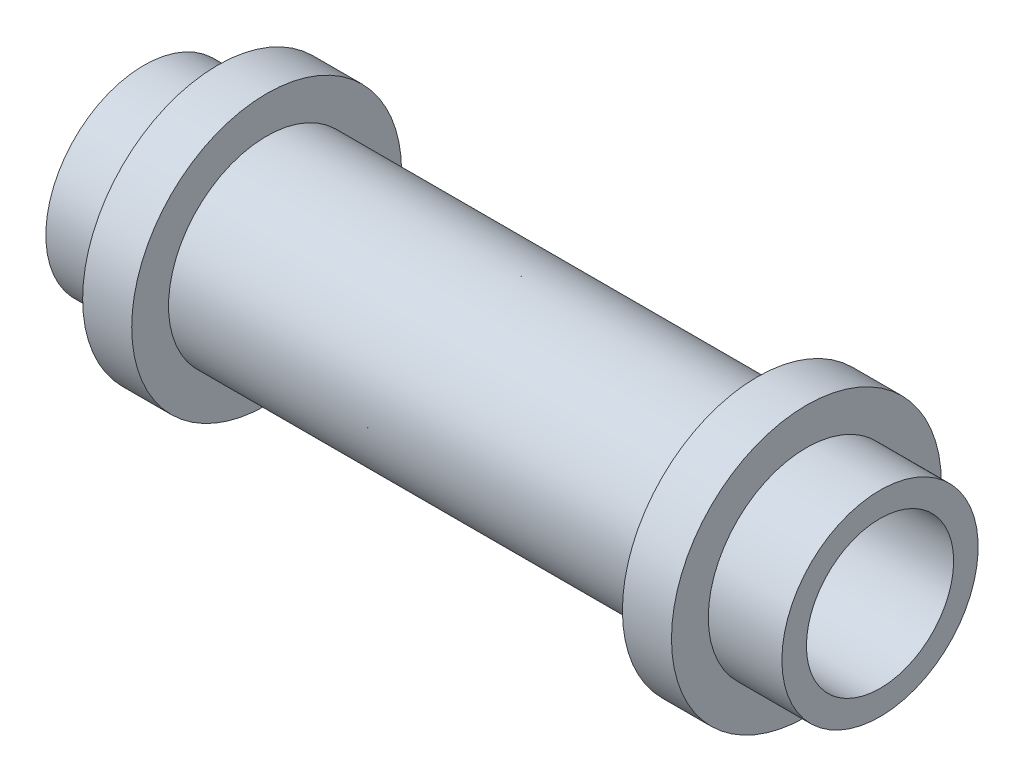
ISO-10303-21;
HEADER;
FILE_DESCRIPTION(('STEP AP214'),'2;1');
FILE_NAME('part.step','',(''),(''),'','','');
FILE_SCHEMA(('AUTOMOTIVE_DESIGN { 1 0 10303 214 1 1 1 1 }'));
ENDSEC;
DATA;
#1=APPLICATION_CONTEXT('core data for automotive mechanical design processes');
#2=APPLICATION_PROTOCOL_DEFINITION('international standard','automotive_design',2000,#1);
#3=PRODUCT_CONTEXT('',#1,'mechanical');
#4=PRODUCT('Part','Part','',(#3));
#5=PRODUCT_RELATED_PRODUCT_CATEGORY('part','',(#4));
#6=PRODUCT_DEFINITION_FORMATION('','',#4);
#7=PRODUCT_DEFINITION_CONTEXT('part definition',#1,'design');
#8=PRODUCT_DEFINITION('design','',#6,#7);
#9=PRODUCT_DEFINITION_SHAPE('','',#8);
#10=(LENGTH_UNIT() NAMED_UNIT(*) SI_UNIT(.MILLI.,.METRE.));
#11=(NAMED_UNIT(*) PLANE_ANGLE_UNIT() SI_UNIT($,.RADIAN.));
#12=(NAMED_UNIT(*) SI_UNIT($,.STERADIAN.) SOLID_ANGLE_UNIT());
#13=UNCERTAINTY_MEASURE_WITH_UNIT(LENGTH_MEASURE(1.E-05),#10,'distance_accuracy_value','');
#14=(GEOMETRIC_REPRESENTATION_CONTEXT(3) GLOBAL_UNCERTAINTY_ASSIGNED_CONTEXT((#13)) GLOBAL_UNIT_ASSIGNED_CONTEXT((#10,
#11,#12)) REPRESENTATION_CONTEXT('',''));
#15=CARTESIAN_POINT('',(0.,0.,0.));
#16=DIRECTION('',(0.,0.,1.));
#17=DIRECTION('',(1.,0.,0.));
#18=AXIS2_PLACEMENT_3D('',#15,#16,#17);
#19=CARTESIAN_POINT('',(3.175,0.,0.));
#20=DIRECTION('',(-1.,0.,0.));
#21=DIRECTION('',(0.,0.,1.));
#22=AXIS2_PLACEMENT_3D('',#19,#20,#21);
#23=CYLINDRICAL_SURFACE('',#22,8.73125);
#24=CARTESIAN_POINT('',(3.175,0.,0.));
#25=DIRECTION('',(1.,0.,0.));
#26=DIRECTION('',(0.,0.,-1.));
#27=AXIS2_PLACEMENT_3D('',#24,#25,#26);
#28=CIRCLE('',#27,8.73125);
#29=CARTESIAN_POINT('',(3.175,0.,-8.73125));
#30=VERTEX_POINT('',#29);
#31=EDGE_CURVE('E69',#30,#30,#28,.T.);
#32=ORIENTED_EDGE('',*,*,#31,.F.);
#33=EDGE_LOOP('',(#32));
#34=FACE_BOUND('',#33,.T.);
#35=CARTESIAN_POINT('',(0.,0.,0.));
#36=DIRECTION('',(1.,0.,0.));
#37=DIRECTION('',(0.,0.,-1.));
#38=AXIS2_PLACEMENT_3D('',#35,#36,#37);
#39=CIRCLE('',#38,8.73125);
#40=CARTESIAN_POINT('',(0.,0.,-8.73125));
#41=VERTEX_POINT('',#40);
#42=EDGE_CURVE('E38',#41,#41,#39,.T.);
#43=ORIENTED_EDGE('',*,*,#42,.T.);
#44=EDGE_LOOP('',(#43));
#45=FACE_BOUND('',#44,.T.);
#46=ADVANCED_FACE('F35',(#34,#45),#23,.T.);
#47=CARTESIAN_POINT('',(3.175,0.,0.));
#48=DIRECTION('',(1.,0.,0.));
#49=DIRECTION('',(0.,0.,-1.));
#50=AXIS2_PLACEMENT_3D('',#47,#48,#49);
#51=PLANE('',#50);
#52=CARTESIAN_POINT('',(3.175,0.,0.));
#53=DIRECTION('',(1.,0.,0.));
#54=DIRECTION('',(0.,0.,-1.));
#55=AXIS2_PLACEMENT_3D('',#52,#53,#54);
#56=CIRCLE('',#55,6.35);
#57=CARTESIAN_POINT('',(3.175,0.,-6.35));
#58=VERTEX_POINT('',#57);
#59=EDGE_CURVE('E47',#58,#58,#56,.T.);
#60=ORIENTED_EDGE('',*,*,#59,.F.);
#61=EDGE_LOOP('',(#60));
#62=FACE_BOUND('',#61,.T.);
#63=ORIENTED_EDGE('',*,*,#31,.T.);
#64=EDGE_LOOP('',(#63));
#65=FACE_BOUND('',#64,.T.);
#66=ADVANCED_FACE('F80',(#62,#65),#51,.T.);
#67=CARTESIAN_POINT('',(0.,0.,0.));
#68=DIRECTION('',(1.,0.,0.));
#69=DIRECTION('',(0.,0.,-1.));
#70=AXIS2_PLACEMENT_3D('',#67,#68,#69);
#71=PLANE('',#70);
#72=CARTESIAN_POINT('',(0.,0.,0.));
#73=DIRECTION('',(-1.,0.,0.));
#74=DIRECTION('',(0.,0.,1.));
#75=AXIS2_PLACEMENT_3D('',#72,#73,#74);
#76=CIRCLE('',#75,6.35);
#77=CARTESIAN_POINT('',(0.,0.,-6.35));
#78=VERTEX_POINT('',#77);
#79=EDGE_CURVE('E42',#78,#78,#76,.T.);
#80=ORIENTED_EDGE('',*,*,#79,.F.);
#81=EDGE_LOOP('',(#80));
#82=FACE_BOUND('',#81,.T.);
#83=ORIENTED_EDGE('',*,*,#42,.F.);
#84=EDGE_LOOP('',(#83));
#85=FACE_BOUND('',#84,.T.);
#86=ADVANCED_FACE('F77',(#82,#85),#71,.F.);
#87=CARTESIAN_POINT('',(19.05,0.,0.));
#88=DIRECTION('',(-1.,0.,0.));
#89=DIRECTION('',(0.,0.,1.));
#90=AXIS2_PLACEMENT_3D('',#87,#88,#89);
#91=CYLINDRICAL_SURFACE('',#90,6.35);
#92=ORIENTED_EDGE('',*,*,#59,.T.);
#93=EDGE_LOOP('',(#92));
#94=FACE_BOUND('',#93,.T.);
#95=CARTESIAN_POINT('',(34.925,0.,0.));
#96=DIRECTION('',(1.,0.,0.));
#97=DIRECTION('',(0.,0.,-1.));
#98=AXIS2_PLACEMENT_3D('',#95,#96,#97);
#99=CIRCLE('',#98,6.35);
#100=CARTESIAN_POINT('',(34.925,0.,-6.35));
#101=VERTEX_POINT('',#100);
#102=EDGE_CURVE('E56',#101,#101,#99,.T.);
#103=ORIENTED_EDGE('',*,*,#102,.F.);
#104=EDGE_LOOP('',(#103));
#105=FACE_BOUND('',#104,.T.);
#106=ADVANCED_FACE('F79',(#94,#105),#91,.T.);
#107=CARTESIAN_POINT('',(-4.7625,0.,0.));
#108=DIRECTION('',(1.,0.,0.));
#109=DIRECTION('',(0.,0.,-1.));
#110=AXIS2_PLACEMENT_3D('',#107,#108,#109);
#111=CYLINDRICAL_SURFACE('',#110,6.35);
#112=CARTESIAN_POINT('',(-4.7625,0.,0.));
#113=DIRECTION('',(-1.,0.,0.));
#114=DIRECTION('',(0.,0.,1.));
#115=AXIS2_PLACEMENT_3D('',#112,#113,#114);
#116=CIRCLE('',#115,6.35);
#117=CARTESIAN_POINT('',(-4.7625,0.,-6.35));
#118=VERTEX_POINT('',#117);
#119=EDGE_CURVE('E65',#118,#118,#116,.T.);
#120=CARTESIAN_POINT('',(-4.7625,0.,-6.35));
#121=CARTESIAN_POINT('',(-4.712890625,0.,-6.35));
#122=CARTESIAN_POINT('',(-4.66328125,0.,-6.35));
#123=CARTESIAN_POINT('',(-4.5640625,0.,-6.35));
#124=CARTESIAN_POINT('',(-4.514453125,0.,-6.35));
#125=CARTESIAN_POINT('',(-4.415234375,0.,-6.35));
#126=CARTESIAN_POINT('',(-4.365625,0.,-6.35));
#127=CARTESIAN_POINT('',(-4.26640625,0.,-6.35));
#128=CARTESIAN_POINT('',(-4.216796875,0.,-6.35));
#129=CARTESIAN_POINT('',(-4.117578125,0.,-6.35));
#130=CARTESIAN_POINT('',(-4.06796875,0.,-6.35));
#131=CARTESIAN_POINT('',(-3.96875,0.,-6.35));
#132=CARTESIAN_POINT('',(-3.919140625,0.,-6.35));
#133=CARTESIAN_POINT('',(-3.819921875,0.,-6.35));
#134=CARTESIAN_POINT('',(-3.7703125,0.,-6.35));
#135=CARTESIAN_POINT('',(-3.67109375,0.,-6.35));
#136=CARTESIAN_POINT('',(-3.621484375,0.,-6.35));
#137=CARTESIAN_POINT('',(-3.522265625,0.,-6.35));
#138=CARTESIAN_POINT('',(-3.47265625,0.,-6.35));
#139=CARTESIAN_POINT('',(-3.3734375,0.,-6.35));
#140=CARTESIAN_POINT('',(-3.323828125,0.,-6.35));
#141=CARTESIAN_POINT('',(-3.224609375,0.,-6.35));
#142=CARTESIAN_POINT('',(-3.175,0.,-6.35));
#143=CARTESIAN_POINT('',(-3.07578125,0.,-6.35));
#144=CARTESIAN_POINT('',(-3.026171875,0.,-6.35));
#145=CARTESIAN_POINT('',(-2.926953125,0.,-6.35));
#146=CARTESIAN_POINT('',(-2.87734375,0.,-6.35));
#147=CARTESIAN_POINT('',(-2.778125,0.,-6.35));
#148=CARTESIAN_POINT('',(-2.728515625,0.,-6.35));
#149=CARTESIAN_POINT('',(-2.629296875,0.,-6.35));
#150=CARTESIAN_POINT('',(-2.5796875,0.,-6.35));
#151=CARTESIAN_POINT('',(-2.48046875,0.,-6.35));
#152=CARTESIAN_POINT('',(-2.430859375,0.,-6.35));
#153=CARTESIAN_POINT('',(-2.331640625,0.,-6.35));
#154=CARTESIAN_POINT('',(-2.28203125,0.,-6.35));
#155=CARTESIAN_POINT('',(-2.1828125,0.,-6.35));
#156=CARTESIAN_POINT('',(-2.133203125,0.,-6.35));
#157=CARTESIAN_POINT('',(-2.033984375,0.,-6.35));
#158=CARTESIAN_POINT('',(-1.984375,0.,-6.35));
#159=CARTESIAN_POINT('',(-1.88515625,0.,-6.35));
#160=CARTESIAN_POINT('',(-1.835546875,0.,-6.35));
#161=CARTESIAN_POINT('',(-1.736328125,0.,-6.35));
#162=CARTESIAN_POINT('',(-1.68671875,0.,-6.35));
#163=CARTESIAN_POINT('',(-1.5875,0.,-6.35));
#164=CARTESIAN_POINT('',(-1.537890625,0.,-6.35));
#165=CARTESIAN_POINT('',(-1.438671875,0.,-6.35));
#166=CARTESIAN_POINT('',(-1.3890625,0.,-6.35));
#167=CARTESIAN_POINT('',(-1.28984375,0.,-6.35));
#168=CARTESIAN_POINT('',(-1.240234375,0.,-6.35));
#169=CARTESIAN_POINT('',(-1.141015625,0.,-6.35));
#170=CARTESIAN_POINT('',(-1.09140625,0.,-6.35));
#171=CARTESIAN_POINT('',(-0.992187499999999,0.,-6.35));
#172=CARTESIAN_POINT('',(-0.942578124999999,0.,-6.35));
#173=CARTESIAN_POINT('',(-0.843359375,0.,-6.35));
#174=CARTESIAN_POINT('',(-0.79375,0.,-6.35));
#175=CARTESIAN_POINT('',(-0.69453125,0.,-6.35));
#176=CARTESIAN_POINT('',(-0.644921875,0.,-6.35));
#177=CARTESIAN_POINT('',(-0.545703125,0.,-6.35));
#178=CARTESIAN_POINT('',(-0.49609375,0.,-6.35));
#179=CARTESIAN_POINT('',(-0.396875,0.,-6.35));
#180=CARTESIAN_POINT('',(-0.347265625,0.,-6.35));
#181=CARTESIAN_POINT('',(-0.248046875,0.,-6.35));
#182=CARTESIAN_POINT('',(-0.1984375,0.,-6.35));
#183=CARTESIAN_POINT('',(-0.09921875,0.,-6.35));
#184=CARTESIAN_POINT('',(-0.049609375,0.,-6.35));
#185=CARTESIAN_POINT('',(0.,0.,-6.35));
#186=B_SPLINE_CURVE_WITH_KNOTS('',3,(#120,#121,#122,#123,#124,#125,#126,#127,#128,#129,#130,
#131,#132,#133,#134,#135,#136,#137,#138,#139,#140,#141,#142,#143,#144,#145,#146,#147,#148,#149,
#150,#151,#152,#153,#154,#155,#156,#157,#158,#159,#160,#161,#162,#163,#164,#165,#166,#167,#168,
#169,#170,#171,#172,#173,#174,#175,#176,#177,#178,#179,#180,#181,#182,#183,#184,#185),
.UNSPECIFIED.,.F.,.F.,(4,2,2,2,2,2,2,2,2,2,2,2,2,2,2,2,2,2,2,2,2,2,2,2,2,2,2,2,2,2,2,2,4),(0.,
0.148828125,0.29765625,0.446484375,0.5953125,0.744140625,0.892968750000001,1.041796875,1.190625,
1.339453125,1.48828125,1.637109375,1.7859375,1.934765625,2.08359375,2.232421875,2.38125,
2.530078125,2.67890625,2.827734375,2.9765625,3.125390625,3.27421875,3.423046875,3.571875,
3.720703125,3.86953125,4.018359375,4.1671875,4.316015625,4.46484375,4.613671875,4.7625),.UNSPECIFIED.);
#187=EDGE_CURVE('BSEAM86',#118,#78,#186,.T.);
#188=ORIENTED_EDGE('',*,*,#119,.F.);
#189=ORIENTED_EDGE('',*,*,#79,.T.);
#190=ORIENTED_EDGE('',*,*,#187,.T.);
#191=ORIENTED_EDGE('',*,*,#187,.F.);
#192=EDGE_LOOP('',(#188,#190,#189,#191));
#193=FACE_BOUND('',#192,.T.);
#194=ADVANCED_FACE('F86',(#193),#111,.T.);
#195=CARTESIAN_POINT('',(-4.7625,0.,0.));
#196=DIRECTION('',(-1.,0.,0.));
#197=DIRECTION('',(0.,0.,1.));
#198=AXIS2_PLACEMENT_3D('',#195,#196,#197);
#199=PLANE('',#198);
#200=CARTESIAN_POINT('',(-4.7625,0.,0.));
#201=DIRECTION('',(-1.,0.,0.));
#202=DIRECTION('',(0.,0.,1.));
#203=AXIS2_PLACEMENT_3D('',#200,#201,#202);
#204=CIRCLE('',#203,4.7625);
#205=CARTESIAN_POINT('',(-4.7625,0.,4.7625));
#206=VERTEX_POINT('',#205);
#207=EDGE_CURVE('E62',#206,#206,#204,.T.);
#208=ORIENTED_EDGE('',*,*,#207,.F.);
#209=EDGE_LOOP('',(#208));
#210=FACE_BOUND('',#209,.T.);
#211=ORIENTED_EDGE('',*,*,#119,.T.);
#212=EDGE_LOOP('',(#211));
#213=FACE_BOUND('',#212,.T.);
#214=ADVANCED_FACE('F114',(#210,#213),#199,.T.);
#215=CARTESIAN_POINT('',(503.2375,0.,0.));
#216=DIRECTION('',(-1.,0.,0.));
#217=DIRECTION('',(0.,0.,1.));
#218=AXIS2_PLACEMENT_3D('',#215,#216,#217);
#219=CYLINDRICAL_SURFACE('',#218,4.7625);
#220=ORIENTED_EDGE('',*,*,#207,.T.);
#221=EDGE_LOOP('',(#220));
#222=FACE_BOUND('',#221,.T.);
#223=CARTESIAN_POINT('',(42.8625,0.,0.));
#224=DIRECTION('',(1.,0.,0.));
#225=DIRECTION('',(0.,0.,-1.));
#226=AXIS2_PLACEMENT_3D('',#223,#224,#225);
#227=CIRCLE('',#226,4.7625);
#228=CARTESIAN_POINT('',(42.8625,0.,-4.7625));
#229=VERTEX_POINT('',#228);
#230=EDGE_CURVE('E199',#229,#229,#227,.T.);
#231=ORIENTED_EDGE('',*,*,#230,.T.);
#232=EDGE_LOOP('',(#231));
#233=FACE_BOUND('',#232,.T.);
#234=ADVANCED_FACE('F124',(#222,#233),#219,.F.);
#235=CARTESIAN_POINT('',(34.925,0.,0.));
#236=DIRECTION('',(1.,0.,0.));
#237=DIRECTION('',(0.,0.,-1.));
#238=AXIS2_PLACEMENT_3D('',#235,#236,#237);
#239=PLANE('',#238);
#240=ORIENTED_EDGE('',*,*,#102,.T.);
#241=EDGE_LOOP('',(#240));
#242=FACE_BOUND('',#241,.T.);
#243=CARTESIAN_POINT('',(34.925,0.,0.));
#244=DIRECTION('',(1.,0.,0.));
#245=DIRECTION('',(0.,0.,-1.));
#246=AXIS2_PLACEMENT_3D('',#243,#244,#245);
#247=CIRCLE('',#246,8.73125);
#248=CARTESIAN_POINT('',(34.925,0.,-8.73125));
#249=VERTEX_POINT('',#248);
#250=EDGE_CURVE('E57',#249,#249,#247,.T.);
#251=ORIENTED_EDGE('',*,*,#250,.F.);
#252=EDGE_LOOP('',(#251));
#253=FACE_BOUND('',#252,.T.);
#254=ADVANCED_FACE('F139',(#242,#253),#239,.F.);
#255=CARTESIAN_POINT('',(38.1,0.,0.));
#256=DIRECTION('',(1.,0.,0.));
#257=DIRECTION('',(0.,0.,-1.));
#258=AXIS2_PLACEMENT_3D('',#255,#256,#257);
#259=PLANE('',#258);
#260=CARTESIAN_POINT('',(38.1,0.,0.));
#261=DIRECTION('',(1.,0.,0.));
#262=DIRECTION('',(0.,0.,-1.));
#263=AXIS2_PLACEMENT_3D('',#260,#261,#262);
#264=CIRCLE('',#263,6.35);
#265=CARTESIAN_POINT('',(38.1,0.,6.35));
#266=VERTEX_POINT('',#265);
#267=EDGE_CURVE('E10',#266,#266,#264,.T.);
#268=ORIENTED_EDGE('',*,*,#267,.F.);
#269=EDGE_LOOP('',(#268));
#270=FACE_BOUND('',#269,.T.);
#271=CARTESIAN_POINT('',(38.1,0.,0.));
#272=DIRECTION('',(1.,0.,0.));
#273=DIRECTION('',(0.,0.,-1.));
#274=AXIS2_PLACEMENT_3D('',#271,#272,#273);
#275=CIRCLE('',#274,8.73125);
#276=CARTESIAN_POINT('',(38.1,0.,-8.73125));
#277=VERTEX_POINT('',#276);
#278=EDGE_CURVE('E53',#277,#277,#275,.T.);
#279=ORIENTED_EDGE('',*,*,#278,.T.);
#280=EDGE_LOOP('',(#279));
#281=FACE_BOUND('',#280,.T.);
#282=ADVANCED_FACE('F144',(#270,#281),#259,.T.);
#283=CARTESIAN_POINT('',(38.1,0.,0.));
#284=DIRECTION('',(-1.,0.,0.));
#285=DIRECTION('',(0.,0.,1.));
#286=AXIS2_PLACEMENT_3D('',#283,#284,#285);
#287=CYLINDRICAL_SURFACE('',#286,8.73125);
#288=ORIENTED_EDGE('',*,*,#278,.F.);
#289=EDGE_LOOP('',(#288));
#290=FACE_BOUND('',#289,.T.);
#291=ORIENTED_EDGE('',*,*,#250,.T.);
#292=EDGE_LOOP('',(#291));
#293=FACE_BOUND('',#292,.T.);
#294=ADVANCED_FACE('F152',(#290,#293),#287,.T.);
#295=CARTESIAN_POINT('',(42.8625,0.,0.));
#296=DIRECTION('',(-1.,0.,0.));
#297=DIRECTION('',(0.,0.,1.));
#298=AXIS2_PLACEMENT_3D('',#295,#296,#297);
#299=CYLINDRICAL_SURFACE('',#298,6.35);
#300=CARTESIAN_POINT('',(42.8625,0.,0.));
#301=DIRECTION('',(1.,0.,0.));
#302=DIRECTION('',(0.,0.,-1.));
#303=AXIS2_PLACEMENT_3D('',#300,#301,#302);
#304=CIRCLE('',#303,6.35);
#305=CARTESIAN_POINT('',(42.8625,0.,6.35));
#306=VERTEX_POINT('',#305);
#307=EDGE_CURVE('E51',#306,#306,#304,.T.);
#308=CARTESIAN_POINT('',(42.8625,0.,6.35));
#309=CARTESIAN_POINT('',(42.812890625,0.,6.35));
#310=CARTESIAN_POINT('',(42.76328125,0.,6.35));
#311=CARTESIAN_POINT('',(42.6640625,0.,6.35));
#312=CARTESIAN_POINT('',(42.614453125,0.,6.35));
#313=CARTESIAN_POINT('',(42.515234375,0.,6.35));
#314=CARTESIAN_POINT('',(42.465625,0.,6.35));
#315=CARTESIAN_POINT('',(42.36640625,0.,6.35));
#316=CARTESIAN_POINT('',(42.316796875,0.,6.35));
#317=CARTESIAN_POINT('',(42.217578125,0.,6.35));
#318=CARTESIAN_POINT('',(42.16796875,0.,6.35));
#319=CARTESIAN_POINT('',(42.06875,0.,6.35));
#320=CARTESIAN_POINT('',(42.019140625,0.,6.35));
#321=CARTESIAN_POINT('',(41.919921875,0.,6.35));
#322=CARTESIAN_POINT('',(41.8703125,0.,6.35));
#323=CARTESIAN_POINT('',(41.77109375,0.,6.35));
#324=CARTESIAN_POINT('',(41.721484375,0.,6.35));
#325=CARTESIAN_POINT('',(41.622265625,0.,6.35));
#326=CARTESIAN_POINT('',(41.57265625,0.,6.35));
#327=CARTESIAN_POINT('',(41.4734375,0.,6.35));
#328=CARTESIAN_POINT('',(41.423828125,0.,6.35));
#329=CARTESIAN_POINT('',(41.324609375,0.,6.35));
#330=CARTESIAN_POINT('',(41.275,0.,6.35));
#331=CARTESIAN_POINT('',(41.17578125,0.,6.35));
#332=CARTESIAN_POINT('',(41.126171875,0.,6.35));
#333=CARTESIAN_POINT('',(41.026953125,0.,6.35));
#334=CARTESIAN_POINT('',(40.97734375,0.,6.35));
#335=CARTESIAN_POINT('',(40.878125,0.,6.35));
#336=CARTESIAN_POINT('',(40.828515625,0.,6.35));
#337=CARTESIAN_POINT('',(40.729296875,0.,6.35));
#338=CARTESIAN_POINT('',(40.6796875,0.,6.35));
#339=CARTESIAN_POINT('',(40.58046875,0.,6.35));
#340=CARTESIAN_POINT('',(40.530859375,0.,6.35));
#341=CARTESIAN_POINT('',(40.431640625,0.,6.35));
#342=CARTESIAN_POINT('',(40.38203125,0.,6.35));
#343=CARTESIAN_POINT('',(40.2828125,0.,6.35));
#344=CARTESIAN_POINT('',(40.233203125,0.,6.35));
#345=CARTESIAN_POINT('',(40.133984375,0.,6.35));
#346=CARTESIAN_POINT('',(40.084375,0.,6.35));
#347=CARTESIAN_POINT('',(39.98515625,0.,6.35));
#348=CARTESIAN_POINT('',(39.935546875,0.,6.35));
#349=CARTESIAN_POINT('',(39.836328125,0.,6.35));
#350=CARTESIAN_POINT('',(39.78671875,0.,6.35));
#351=CARTESIAN_POINT('',(39.6875,0.,6.35));
#352=CARTESIAN_POINT('',(39.637890625,0.,6.35));
#353=CARTESIAN_POINT('',(39.538671875,0.,6.35));
#354=CARTESIAN_POINT('',(39.4890625,0.,6.35));
#355=CARTESIAN_POINT('',(39.38984375,0.,6.35));
#356=CARTESIAN_POINT('',(39.340234375,0.,6.35));
#357=CARTESIAN_POINT('',(39.241015625,0.,6.35));
#358=CARTESIAN_POINT('',(39.19140625,0.,6.35));
#359=CARTESIAN_POINT('',(39.0921875,0.,6.35));
#360=CARTESIAN_POINT('',(39.042578125,0.,6.35));
#361=CARTESIAN_POINT('',(38.943359375,0.,6.35));
#362=CARTESIAN_POINT('',(38.89375,0.,6.35));
#363=CARTESIAN_POINT('',(38.79453125,0.,6.35));
#364=CARTESIAN_POINT('',(38.744921875,0.,6.35));
#365=CARTESIAN_POINT('',(38.645703125,0.,6.35));
#366=CARTESIAN_POINT('',(38.59609375,0.,6.35));
#367=CARTESIAN_POINT('',(38.496875,0.,6.35));
#368=CARTESIAN_POINT('',(38.447265625,0.,6.35));
#369=CARTESIAN_POINT('',(38.348046875,0.,6.35));
#370=CARTESIAN_POINT('',(38.2984375,0.,6.35));
#371=CARTESIAN_POINT('',(38.19921875,0.,6.35));
#372=CARTESIAN_POINT('',(38.149609375,0.,6.35));
#373=CARTESIAN_POINT('',(38.1,0.,6.35));
#374=B_SPLINE_CURVE_WITH_KNOTS('',3,(#308,#309,#310,#311,#312,#313,#314,#315,#316,#317,#318,
#319,#320,#321,#322,#323,#324,#325,#326,#327,#328,#329,#330,#331,#332,#333,#334,#335,#336,#337,
#338,#339,#340,#341,#342,#343,#344,#345,#346,#347,#348,#349,#350,#351,#352,#353,#354,#355,#356,
#357,#358,#359,#360,#361,#362,#363,#364,#365,#366,#367,#368,#369,#370,#371,#372,#373),
.UNSPECIFIED.,.F.,.F.,(4,2,2,2,2,2,2,2,2,2,2,2,2,2,2,2,2,2,2,2,2,2,2,2,2,2,2,2,2,2,2,2,4),(0.,
0.148828124999993,0.297656249999993,0.446484374999993,0.595312499999993,0.744140624999994,
0.892968749999994,1.04179687499999,1.19062499999999,1.33945312499999,1.48828124999999,
1.63710937499999,1.78593749999999,1.93476562499999,2.08359374999999,2.23242187499999,
2.38124999999999,2.53007812499999,2.67890624999999,2.82773437499999,2.97656249999999,
3.12539062499999,3.27421874999999,3.42304687499999,3.571875,3.720703125,3.86953125,4.018359375,
4.1671875,4.316015625,4.46484375,4.613671875,4.7625),.UNSPECIFIED.);
#375=EDGE_CURVE('BSEAM157',#306,#266,#374,.T.);
#376=ORIENTED_EDGE('',*,*,#307,.F.);
#377=ORIENTED_EDGE('',*,*,#267,.T.);
#378=ORIENTED_EDGE('',*,*,#375,.T.);
#379=ORIENTED_EDGE('',*,*,#375,.F.);
#380=EDGE_LOOP('',(#376,#378,#377,#379));
#381=FACE_BOUND('',#380,.T.);
#382=ADVANCED_FACE('F157',(#381),#299,.T.);
#383=CARTESIAN_POINT('',(42.8625,0.,0.));
#384=DIRECTION('',(1.,0.,0.));
#385=DIRECTION('',(0.,0.,-1.));
#386=AXIS2_PLACEMENT_3D('',#383,#384,#385);
#387=PLANE('',#386);
#388=ORIENTED_EDGE('',*,*,#230,.F.);
#389=EDGE_LOOP('',(#388));
#390=FACE_BOUND('',#389,.T.);
#391=ORIENTED_EDGE('',*,*,#307,.T.);
#392=EDGE_LOOP('',(#391));
#393=FACE_BOUND('',#392,.T.);
#394=ADVANCED_FACE('F174',(#390,#393),#387,.T.);
#395=CLOSED_SHELL('',(#46,#66,#86,#106,#194,#214,#234,#254,#282,#294,#382,#394));
#396=MANIFOLD_SOLID_BREP('B2',#395);
#397=ADVANCED_BREP_SHAPE_REPRESENTATION('',(#18,#396),#14);
#398=SHAPE_DEFINITION_REPRESENTATION(#9,#397);
ENDSEC;
END-ISO-10303-21;
